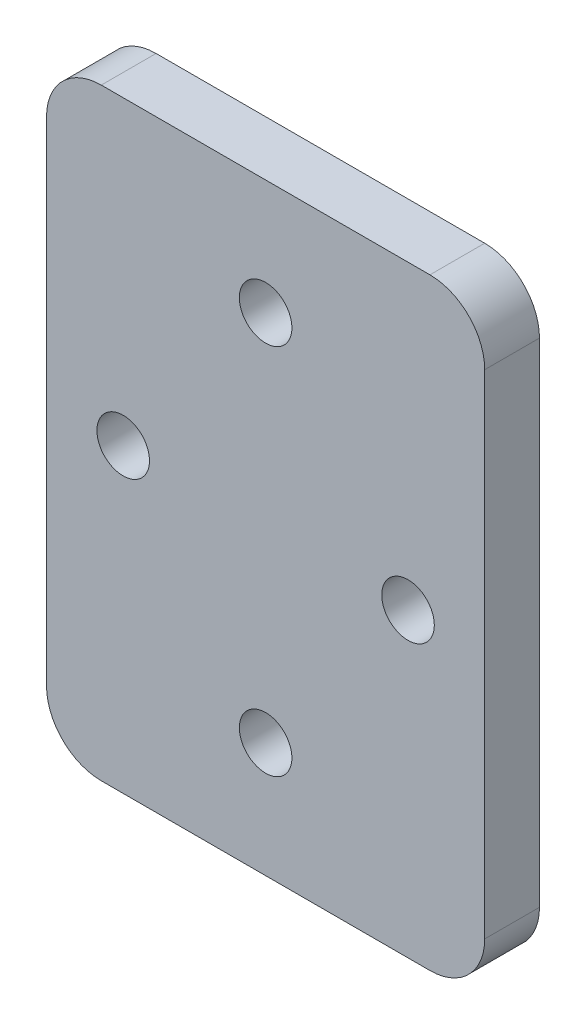
ISO-10303-21;
HEADER;
FILE_DESCRIPTION(('STEP AP214'),'2;1');
FILE_NAME('part.step','',(''),(''),'','','');
FILE_SCHEMA(('AUTOMOTIVE_DESIGN { 1 0 10303 214 1 1 1 1 }'));
ENDSEC;
DATA;
#1=APPLICATION_CONTEXT('core data for automotive mechanical design processes');
#2=APPLICATION_PROTOCOL_DEFINITION('international standard','automotive_design',2000,#1);
#3=PRODUCT_CONTEXT('',#1,'mechanical');
#4=PRODUCT('Part','Part','',(#3));
#5=PRODUCT_RELATED_PRODUCT_CATEGORY('part','',(#4));
#6=PRODUCT_DEFINITION_FORMATION('','',#4);
#7=PRODUCT_DEFINITION_CONTEXT('part definition',#1,'design');
#8=PRODUCT_DEFINITION('design','',#6,#7);
#9=PRODUCT_DEFINITION_SHAPE('','',#8);
#10=(LENGTH_UNIT() NAMED_UNIT(*) SI_UNIT(.MILLI.,.METRE.));
#11=(NAMED_UNIT(*) PLANE_ANGLE_UNIT() SI_UNIT($,.RADIAN.));
#12=(NAMED_UNIT(*) SI_UNIT($,.STERADIAN.) SOLID_ANGLE_UNIT());
#13=UNCERTAINTY_MEASURE_WITH_UNIT(LENGTH_MEASURE(1.E-05),#10,'distance_accuracy_value','');
#14=(GEOMETRIC_REPRESENTATION_CONTEXT(3) GLOBAL_UNCERTAINTY_ASSIGNED_CONTEXT((#13)) GLOBAL_UNIT_ASSIGNED_CONTEXT((#10,
#11,#12)) REPRESENTATION_CONTEXT('',''));
#15=CARTESIAN_POINT('',(0.,0.,0.));
#16=DIRECTION('',(0.,0.,1.));
#17=DIRECTION('',(1.,0.,0.));
#18=AXIS2_PLACEMENT_3D('',#15,#16,#17);
#19=CARTESIAN_POINT('',(0.,0.,5.));
#20=DIRECTION('',(0.,0.,1.));
#21=DIRECTION('',(1.,0.,0.));
#22=AXIS2_PLACEMENT_3D('',#19,#20,#21);
#23=PLANE('',#22);
#24=CARTESIAN_POINT('',(0.,-17.,5.));
#25=DIRECTION('',(0.,0.,1.));
#26=DIRECTION('',(-1.,0.,0.));
#27=AXIS2_PLACEMENT_3D('',#24,#25,#26);
#28=CIRCLE('',#27,2.4);
#29=CARTESIAN_POINT('',(-2.4,-17.,5.));
#30=VERTEX_POINT('',#29);
#31=EDGE_CURVE('E187',#30,#30,#28,.T.);
#32=ORIENTED_EDGE('',*,*,#31,.F.);
#33=EDGE_LOOP('',(#32));
#34=FACE_BOUND('',#33,.T.);
#35=CARTESIAN_POINT('',(0.,17.,5.));
#36=DIRECTION('',(0.,0.,1.));
#37=DIRECTION('',(1.,0.,0.));
#38=AXIS2_PLACEMENT_3D('',#35,#36,#37);
#39=CIRCLE('',#38,2.4);
#40=CARTESIAN_POINT('',(2.4,17.,5.));
#41=VERTEX_POINT('',#40);
#42=EDGE_CURVE('E173',#41,#41,#39,.T.);
#43=ORIENTED_EDGE('',*,*,#42,.F.);
#44=EDGE_LOOP('',(#43));
#45=FACE_BOUND('',#44,.T.);
#46=DIRECTION('',(-1.,0.,0.));
#47=VECTOR('',#46,1.);
#48=CARTESIAN_POINT('',(-20.,27.5,5.));
#49=LINE('',#48,#47);
#50=CARTESIAN_POINT('',(15.,27.5,5.));
#51=VERTEX_POINT('',#50);
#52=CARTESIAN_POINT('',(-15.,27.5,5.));
#53=VERTEX_POINT('',#52);
#54=EDGE_CURVE('E168',#51,#53,#49,.T.);
#55=ORIENTED_EDGE('',*,*,#54,.T.);
#56=CARTESIAN_POINT('',(-15.,22.5,5.));
#57=DIRECTION('',(0.,0.,1.));
#58=DIRECTION('',(1.,0.,0.));
#59=AXIS2_PLACEMENT_3D('',#56,#57,#58);
#60=CIRCLE('',#59,5.);
#61=CARTESIAN_POINT('',(-20.,22.5,5.));
#62=VERTEX_POINT('',#61);
#63=EDGE_CURVE('E149',#53,#62,#60,.T.);
#64=ORIENTED_EDGE('',*,*,#63,.T.);
#65=DIRECTION('',(0.,-1.,0.));
#66=VECTOR('',#65,1.);
#67=CARTESIAN_POINT('',(-20.,27.5,5.));
#68=LINE('',#67,#66);
#69=CARTESIAN_POINT('',(-20.,-22.5,5.));
#70=VERTEX_POINT('',#69);
#71=EDGE_CURVE('E119',#62,#70,#68,.T.);
#72=ORIENTED_EDGE('',*,*,#71,.T.);
#73=CARTESIAN_POINT('',(-15.,-22.5,5.));
#74=DIRECTION('',(0.,0.,1.));
#75=DIRECTION('',(1.,0.,0.));
#76=AXIS2_PLACEMENT_3D('',#73,#74,#75);
#77=CIRCLE('',#76,5.);
#78=CARTESIAN_POINT('',(-15.,-27.5,5.));
#79=VERTEX_POINT('',#78);
#80=EDGE_CURVE('E55',#70,#79,#77,.T.);
#81=ORIENTED_EDGE('',*,*,#80,.T.);
#82=DIRECTION('',(1.,0.,0.));
#83=VECTOR('',#82,1.);
#84=CARTESIAN_POINT('',(-20.,-27.5,5.));
#85=LINE('',#84,#83);
#86=CARTESIAN_POINT('',(15.,-27.5,5.));
#87=VERTEX_POINT('',#86);
#88=EDGE_CURVE('E135',#79,#87,#85,.T.);
#89=ORIENTED_EDGE('',*,*,#88,.T.);
#90=CARTESIAN_POINT('',(15.,-22.5,5.));
#91=DIRECTION('',(0.,0.,1.));
#92=DIRECTION('',(1.,0.,0.));
#93=AXIS2_PLACEMENT_3D('',#90,#91,#92);
#94=CIRCLE('',#93,5.);
#95=CARTESIAN_POINT('',(20.,-22.5,5.));
#96=VERTEX_POINT('',#95);
#97=EDGE_CURVE('E146',#87,#96,#94,.T.);
#98=ORIENTED_EDGE('',*,*,#97,.T.);
#99=DIRECTION('',(0.,1.,0.));
#100=VECTOR('',#99,1.);
#101=CARTESIAN_POINT('',(20.,27.5,5.));
#102=LINE('',#101,#100);
#103=CARTESIAN_POINT('',(20.,22.5,5.));
#104=VERTEX_POINT('',#103);
#105=EDGE_CURVE('E129',#96,#104,#102,.T.);
#106=ORIENTED_EDGE('',*,*,#105,.T.);
#107=CARTESIAN_POINT('',(15.,22.5,5.));
#108=DIRECTION('',(0.,0.,1.));
#109=DIRECTION('',(1.,0.,0.));
#110=AXIS2_PLACEMENT_3D('',#107,#108,#109);
#111=CIRCLE('',#110,5.);
#112=EDGE_CURVE('E144',#104,#51,#111,.T.);
#113=ORIENTED_EDGE('',*,*,#112,.T.);
#114=EDGE_LOOP('',(#55,#64,#72,#81,#89,#98,#106,#113));
#115=FACE_BOUND('',#114,.T.);
#116=CARTESIAN_POINT('',(13.,0.,5.));
#117=DIRECTION('',(0.,0.,1.));
#118=DIRECTION('',(1.,0.,0.));
#119=AXIS2_PLACEMENT_3D('',#116,#117,#118);
#120=CIRCLE('',#119,2.4);
#121=CARTESIAN_POINT('',(15.4,0.,5.));
#122=VERTEX_POINT('',#121);
#123=EDGE_CURVE('E182',#122,#122,#120,.T.);
#124=ORIENTED_EDGE('',*,*,#123,.F.);
#125=EDGE_LOOP('',(#124));
#126=FACE_BOUND('',#125,.T.);
#127=CARTESIAN_POINT('',(-13.,0.,5.));
#128=DIRECTION('',(0.,0.,1.));
#129=DIRECTION('',(-1.,0.,0.));
#130=AXIS2_PLACEMENT_3D('',#127,#128,#129);
#131=CIRCLE('',#130,2.4);
#132=CARTESIAN_POINT('',(-15.4,0.,5.));
#133=VERTEX_POINT('',#132);
#134=EDGE_CURVE('E193',#133,#133,#131,.T.);
#135=ORIENTED_EDGE('',*,*,#134,.F.);
#136=EDGE_LOOP('',(#135));
#137=FACE_BOUND('',#136,.T.);
#138=ADVANCED_FACE('F33',(#34,#45,#115,#126,#137),#23,.T.);
#139=CARTESIAN_POINT('',(0.,0.,0.));
#140=DIRECTION('',(0.,0.,1.));
#141=DIRECTION('',(1.,0.,0.));
#142=AXIS2_PLACEMENT_3D('',#139,#140,#141);
#143=PLANE('',#142);
#144=DIRECTION('',(0.,-1.,0.));
#145=VECTOR('',#144,1.);
#146=CARTESIAN_POINT('',(-20.,27.5,0.));
#147=LINE('',#146,#145);
#148=CARTESIAN_POINT('',(-20.,22.5,0.));
#149=VERTEX_POINT('',#148);
#150=CARTESIAN_POINT('',(-20.,-22.5,0.));
#151=VERTEX_POINT('',#150);
#152=EDGE_CURVE('E117',#149,#151,#147,.T.);
#153=ORIENTED_EDGE('',*,*,#152,.F.);
#154=CARTESIAN_POINT('',(-15.,22.5,0.));
#155=DIRECTION('',(0.,0.,1.));
#156=DIRECTION('',(1.,0.,0.));
#157=AXIS2_PLACEMENT_3D('',#154,#155,#156);
#158=CIRCLE('',#157,5.);
#159=CARTESIAN_POINT('',(-15.,27.5,0.));
#160=VERTEX_POINT('',#159);
#161=EDGE_CURVE('E100',#149,#160,#158,.F.);
#162=ORIENTED_EDGE('',*,*,#161,.T.);
#163=DIRECTION('',(-1.,0.,0.));
#164=VECTOR('',#163,1.);
#165=CARTESIAN_POINT('',(-20.,27.5,0.));
#166=LINE('',#165,#164);
#167=CARTESIAN_POINT('',(15.,27.5,0.));
#168=VERTEX_POINT('',#167);
#169=EDGE_CURVE('E127',#168,#160,#166,.T.);
#170=ORIENTED_EDGE('',*,*,#169,.F.);
#171=CARTESIAN_POINT('',(15.,22.5,0.));
#172=DIRECTION('',(0.,0.,1.));
#173=DIRECTION('',(1.,0.,0.));
#174=AXIS2_PLACEMENT_3D('',#171,#172,#173);
#175=CIRCLE('',#174,5.);
#176=CARTESIAN_POINT('',(20.,22.5,0.));
#177=VERTEX_POINT('',#176);
#178=EDGE_CURVE('E120',#168,#177,#175,.F.);
#179=ORIENTED_EDGE('',*,*,#178,.T.);
#180=DIRECTION('',(0.,1.,0.));
#181=VECTOR('',#180,1.);
#182=CARTESIAN_POINT('',(20.,27.5,0.));
#183=LINE('',#182,#181);
#184=CARTESIAN_POINT('',(20.,-22.5,0.));
#185=VERTEX_POINT('',#184);
#186=EDGE_CURVE('E131',#185,#177,#183,.T.);
#187=ORIENTED_EDGE('',*,*,#186,.F.);
#188=CARTESIAN_POINT('',(15.,-22.5,0.));
#189=DIRECTION('',(0.,0.,1.));
#190=DIRECTION('',(1.,0.,0.));
#191=AXIS2_PLACEMENT_3D('',#188,#189,#190);
#192=CIRCLE('',#191,5.);
#193=CARTESIAN_POINT('',(15.,-27.5,0.));
#194=VERTEX_POINT('',#193);
#195=EDGE_CURVE('E138',#185,#194,#192,.F.);
#196=ORIENTED_EDGE('',*,*,#195,.T.);
#197=DIRECTION('',(1.,0.,0.));
#198=VECTOR('',#197,1.);
#199=CARTESIAN_POINT('',(-20.,-27.5,0.));
#200=LINE('',#199,#198);
#201=CARTESIAN_POINT('',(-15.,-27.5,0.));
#202=VERTEX_POINT('',#201);
#203=EDGE_CURVE('E126',#202,#194,#200,.T.);
#204=ORIENTED_EDGE('',*,*,#203,.F.);
#205=CARTESIAN_POINT('',(-15.,-22.5,0.));
#206=DIRECTION('',(0.,0.,1.));
#207=DIRECTION('',(1.,0.,0.));
#208=AXIS2_PLACEMENT_3D('',#205,#206,#207);
#209=CIRCLE('',#208,5.);
#210=EDGE_CURVE('E111',#202,#151,#209,.F.);
#211=ORIENTED_EDGE('',*,*,#210,.T.);
#212=EDGE_LOOP('',(#153,#162,#170,#179,#187,#196,#204,#211));
#213=FACE_BOUND('',#212,.T.);
#214=CARTESIAN_POINT('',(0.,17.,0.));
#215=DIRECTION('',(0.,0.,1.));
#216=DIRECTION('',(1.,0.,0.));
#217=AXIS2_PLACEMENT_3D('',#214,#215,#216);
#218=CIRCLE('',#217,2.4);
#219=CARTESIAN_POINT('',(2.4,17.,0.));
#220=VERTEX_POINT('',#219);
#221=EDGE_CURVE('E175',#220,#220,#218,.T.);
#222=ORIENTED_EDGE('',*,*,#221,.T.);
#223=EDGE_LOOP('',(#222));
#224=FACE_BOUND('',#223,.T.);
#225=CARTESIAN_POINT('',(13.,0.,0.));
#226=DIRECTION('',(0.,0.,1.));
#227=DIRECTION('',(1.,0.,0.));
#228=AXIS2_PLACEMENT_3D('',#225,#226,#227);
#229=CIRCLE('',#228,2.4);
#230=CARTESIAN_POINT('',(15.4,0.,0.));
#231=VERTEX_POINT('',#230);
#232=EDGE_CURVE('E184',#231,#231,#229,.T.);
#233=ORIENTED_EDGE('',*,*,#232,.T.);
#234=EDGE_LOOP('',(#233));
#235=FACE_BOUND('',#234,.T.);
#236=CARTESIAN_POINT('',(0.,-17.,0.));
#237=DIRECTION('',(0.,0.,1.));
#238=DIRECTION('',(-1.,0.,0.));
#239=AXIS2_PLACEMENT_3D('',#236,#237,#238);
#240=CIRCLE('',#239,2.4);
#241=CARTESIAN_POINT('',(-2.4,-17.,0.));
#242=VERTEX_POINT('',#241);
#243=EDGE_CURVE('E190',#242,#242,#240,.T.);
#244=ORIENTED_EDGE('',*,*,#243,.T.);
#245=EDGE_LOOP('',(#244));
#246=FACE_BOUND('',#245,.T.);
#247=CARTESIAN_POINT('',(-13.,0.,0.));
#248=DIRECTION('',(0.,0.,1.));
#249=DIRECTION('',(-1.,0.,0.));
#250=AXIS2_PLACEMENT_3D('',#247,#248,#249);
#251=CIRCLE('',#250,2.4);
#252=CARTESIAN_POINT('',(-15.4,0.,0.));
#253=VERTEX_POINT('',#252);
#254=EDGE_CURVE('E196',#253,#253,#251,.T.);
#255=ORIENTED_EDGE('',*,*,#254,.T.);
#256=EDGE_LOOP('',(#255));
#257=FACE_BOUND('',#256,.T.);
#258=ADVANCED_FACE('F123',(#213,#224,#235,#246,#257),#143,.F.);
#259=CARTESIAN_POINT('',(20.,27.5,5.));
#260=DIRECTION('',(-1.,0.,0.));
#261=DIRECTION('',(0.,0.,1.));
#262=AXIS2_PLACEMENT_3D('',#259,#260,#261);
#263=PLANE('',#262);
#264=ORIENTED_EDGE('',*,*,#105,.F.);
#265=DIRECTION('',(0.,0.,-1.));
#266=VECTOR('',#265,1.);
#267=CARTESIAN_POINT('',(20.,-22.5,5.));
#268=LINE('',#267,#266);
#269=EDGE_CURVE('E11',#96,#185,#268,.T.);
#270=ORIENTED_EDGE('',*,*,#269,.T.);
#271=ORIENTED_EDGE('',*,*,#186,.T.);
#272=DIRECTION('',(0.,0.,-1.));
#273=VECTOR('',#272,1.);
#274=CARTESIAN_POINT('',(20.,22.5,5.));
#275=LINE('',#274,#273);
#276=EDGE_CURVE('E41',#177,#104,#275,.F.);
#277=ORIENTED_EDGE('',*,*,#276,.T.);
#278=EDGE_LOOP('',(#264,#270,#271,#277));
#279=FACE_BOUND('',#278,.T.);
#280=ADVANCED_FACE('F159',(#279),#263,.F.);
#281=CARTESIAN_POINT('',(-20.,27.5,5.));
#282=DIRECTION('',(0.,-1.,0.));
#283=DIRECTION('',(0.,0.,-1.));
#284=AXIS2_PLACEMENT_3D('',#281,#282,#283);
#285=PLANE('',#284);
#286=ORIENTED_EDGE('',*,*,#169,.T.);
#287=DIRECTION('',(0.,0.,-1.));
#288=VECTOR('',#287,1.);
#289=CARTESIAN_POINT('',(-15.,27.5,5.));
#290=LINE('',#289,#288);
#291=EDGE_CURVE('E105',#160,#53,#290,.F.);
#292=ORIENTED_EDGE('',*,*,#291,.T.);
#293=ORIENTED_EDGE('',*,*,#54,.F.);
#294=DIRECTION('',(0.,0.,-1.));
#295=VECTOR('',#294,1.);
#296=CARTESIAN_POINT('',(15.,27.5,5.));
#297=LINE('',#296,#295);
#298=EDGE_CURVE('E110',#51,#168,#297,.T.);
#299=ORIENTED_EDGE('',*,*,#298,.T.);
#300=EDGE_LOOP('',(#286,#292,#293,#299));
#301=FACE_BOUND('',#300,.T.);
#302=ADVANCED_FACE('F172',(#301),#285,.F.);
#303=CARTESIAN_POINT('',(-20.,27.5,5.));
#304=DIRECTION('',(1.,0.,0.));
#305=DIRECTION('',(0.,0.,-1.));
#306=AXIS2_PLACEMENT_3D('',#303,#304,#305);
#307=PLANE('',#306);
#308=ORIENTED_EDGE('',*,*,#71,.F.);
#309=DIRECTION('',(0.,0.,-1.));
#310=VECTOR('',#309,1.);
#311=CARTESIAN_POINT('',(-20.,22.5,5.));
#312=LINE('',#311,#310);
#313=EDGE_CURVE('E104',#62,#149,#312,.T.);
#314=ORIENTED_EDGE('',*,*,#313,.T.);
#315=ORIENTED_EDGE('',*,*,#152,.T.);
#316=DIRECTION('',(0.,0.,-1.));
#317=VECTOR('',#316,1.);
#318=CARTESIAN_POINT('',(-20.,-22.5,5.));
#319=LINE('',#318,#317);
#320=EDGE_CURVE('E121',#151,#70,#319,.F.);
#321=ORIENTED_EDGE('',*,*,#320,.T.);
#322=EDGE_LOOP('',(#308,#314,#315,#321));
#323=FACE_BOUND('',#322,.T.);
#324=ADVANCED_FACE('F116',(#323),#307,.F.);
#325=CARTESIAN_POINT('',(-20.,-27.5,5.));
#326=DIRECTION('',(0.,1.,0.));
#327=DIRECTION('',(0.,0.,1.));
#328=AXIS2_PLACEMENT_3D('',#325,#326,#327);
#329=PLANE('',#328);
#330=ORIENTED_EDGE('',*,*,#88,.F.);
#331=DIRECTION('',(0.,0.,-1.));
#332=VECTOR('',#331,1.);
#333=CARTESIAN_POINT('',(-15.,-27.5,5.));
#334=LINE('',#333,#332);
#335=EDGE_CURVE('E152',#79,#202,#334,.T.);
#336=ORIENTED_EDGE('',*,*,#335,.T.);
#337=ORIENTED_EDGE('',*,*,#203,.T.);
#338=DIRECTION('',(0.,0.,-1.));
#339=VECTOR('',#338,1.);
#340=CARTESIAN_POINT('',(15.,-27.5,5.));
#341=LINE('',#340,#339);
#342=EDGE_CURVE('E48',#194,#87,#341,.F.);
#343=ORIENTED_EDGE('',*,*,#342,.T.);
#344=EDGE_LOOP('',(#330,#336,#337,#343));
#345=FACE_BOUND('',#344,.T.);
#346=ADVANCED_FACE('F218',(#345),#329,.F.);
#347=CARTESIAN_POINT('',(0.,17.,5.));
#348=DIRECTION('',(0.,0.,-1.));
#349=DIRECTION('',(-1.,0.,0.));
#350=AXIS2_PLACEMENT_3D('',#347,#348,#349);
#351=CYLINDRICAL_SURFACE('',#350,2.4);
#352=ORIENTED_EDGE('',*,*,#42,.T.);
#353=EDGE_LOOP('',(#352));
#354=FACE_BOUND('',#353,.T.);
#355=ORIENTED_EDGE('',*,*,#221,.F.);
#356=EDGE_LOOP('',(#355));
#357=FACE_BOUND('',#356,.T.);
#358=ADVANCED_FACE('F215',(#354,#357),#351,.F.);
#359=CARTESIAN_POINT('',(13.,0.,5.));
#360=DIRECTION('',(0.,0.,-1.));
#361=DIRECTION('',(-1.,0.,0.));
#362=AXIS2_PLACEMENT_3D('',#359,#360,#361);
#363=CYLINDRICAL_SURFACE('',#362,2.4);
#364=ORIENTED_EDGE('',*,*,#123,.T.);
#365=EDGE_LOOP('',(#364));
#366=FACE_BOUND('',#365,.T.);
#367=ORIENTED_EDGE('',*,*,#232,.F.);
#368=EDGE_LOOP('',(#367));
#369=FACE_BOUND('',#368,.T.);
#370=ADVANCED_FACE('F310',(#366,#369),#363,.F.);
#371=CARTESIAN_POINT('',(0.,-17.,5.));
#372=DIRECTION('',(0.,0.,-1.));
#373=DIRECTION('',(-1.,0.,0.));
#374=AXIS2_PLACEMENT_3D('',#371,#372,#373);
#375=CYLINDRICAL_SURFACE('',#374,2.4);
#376=ORIENTED_EDGE('',*,*,#31,.T.);
#377=EDGE_LOOP('',(#376));
#378=FACE_BOUND('',#377,.T.);
#379=ORIENTED_EDGE('',*,*,#243,.F.);
#380=EDGE_LOOP('',(#379));
#381=FACE_BOUND('',#380,.T.);
#382=ADVANCED_FACE('F301',(#378,#381),#375,.F.);
#383=CARTESIAN_POINT('',(-13.,0.,5.));
#384=DIRECTION('',(0.,0.,-1.));
#385=DIRECTION('',(-1.,0.,0.));
#386=AXIS2_PLACEMENT_3D('',#383,#384,#385);
#387=CYLINDRICAL_SURFACE('',#386,2.4);
#388=ORIENTED_EDGE('',*,*,#134,.T.);
#389=EDGE_LOOP('',(#388));
#390=FACE_BOUND('',#389,.T.);
#391=ORIENTED_EDGE('',*,*,#254,.F.);
#392=EDGE_LOOP('',(#391));
#393=FACE_BOUND('',#392,.T.);
#394=ADVANCED_FACE('F202',(#390,#393),#387,.F.);
#395=CARTESIAN_POINT('',(-15.,22.5,5.));
#396=DIRECTION('',(0.,0.,-1.));
#397=DIRECTION('',(-1.,0.,0.));
#398=AXIS2_PLACEMENT_3D('',#395,#396,#397);
#399=CYLINDRICAL_SURFACE('',#398,5.);
#400=ORIENTED_EDGE('',*,*,#63,.F.);
#401=ORIENTED_EDGE('',*,*,#291,.F.);
#402=ORIENTED_EDGE('',*,*,#161,.F.);
#403=ORIENTED_EDGE('',*,*,#313,.F.);
#404=EDGE_LOOP('',(#400,#401,#402,#403));
#405=FACE_BOUND('',#404,.T.);
#406=ADVANCED_FACE('F103',(#405),#399,.T.);
#407=CARTESIAN_POINT('',(-15.,-22.5,5.));
#408=DIRECTION('',(0.,0.,-1.));
#409=DIRECTION('',(-1.,0.,0.));
#410=AXIS2_PLACEMENT_3D('',#407,#408,#409);
#411=CYLINDRICAL_SURFACE('',#410,5.);
#412=ORIENTED_EDGE('',*,*,#80,.F.);
#413=ORIENTED_EDGE('',*,*,#320,.F.);
#414=ORIENTED_EDGE('',*,*,#210,.F.);
#415=ORIENTED_EDGE('',*,*,#335,.F.);
#416=EDGE_LOOP('',(#412,#413,#414,#415));
#417=FACE_BOUND('',#416,.T.);
#418=ADVANCED_FACE('F229',(#417),#411,.T.);
#419=CARTESIAN_POINT('',(15.,-22.5,5.));
#420=DIRECTION('',(0.,0.,-1.));
#421=DIRECTION('',(-1.,0.,0.));
#422=AXIS2_PLACEMENT_3D('',#419,#420,#421);
#423=CYLINDRICAL_SURFACE('',#422,5.);
#424=ORIENTED_EDGE('',*,*,#97,.F.);
#425=ORIENTED_EDGE('',*,*,#342,.F.);
#426=ORIENTED_EDGE('',*,*,#195,.F.);
#427=ORIENTED_EDGE('',*,*,#269,.F.);
#428=EDGE_LOOP('',(#424,#425,#426,#427));
#429=FACE_BOUND('',#428,.T.);
#430=ADVANCED_FACE('F231',(#429),#423,.T.);
#431=CARTESIAN_POINT('',(15.,22.5,5.));
#432=DIRECTION('',(0.,0.,-1.));
#433=DIRECTION('',(-1.,0.,0.));
#434=AXIS2_PLACEMENT_3D('',#431,#432,#433);
#435=CYLINDRICAL_SURFACE('',#434,5.);
#436=ORIENTED_EDGE('',*,*,#112,.F.);
#437=ORIENTED_EDGE('',*,*,#276,.F.);
#438=ORIENTED_EDGE('',*,*,#178,.F.);
#439=ORIENTED_EDGE('',*,*,#298,.F.);
#440=EDGE_LOOP('',(#436,#437,#438,#439));
#441=FACE_BOUND('',#440,.T.);
#442=ADVANCED_FACE('F35',(#441),#435,.T.);
#443=CLOSED_SHELL('',(#138,#258,#280,#302,#324,#346,#358,#370,#382,#394,#406,#418,#430,#442));
#444=MANIFOLD_SOLID_BREP('B2',#443);
#445=ADVANCED_BREP_SHAPE_REPRESENTATION('',(#18,#444),#14);
#446=SHAPE_DEFINITION_REPRESENTATION(#9,#445);
ENDSEC;
END-ISO-10303-21;
